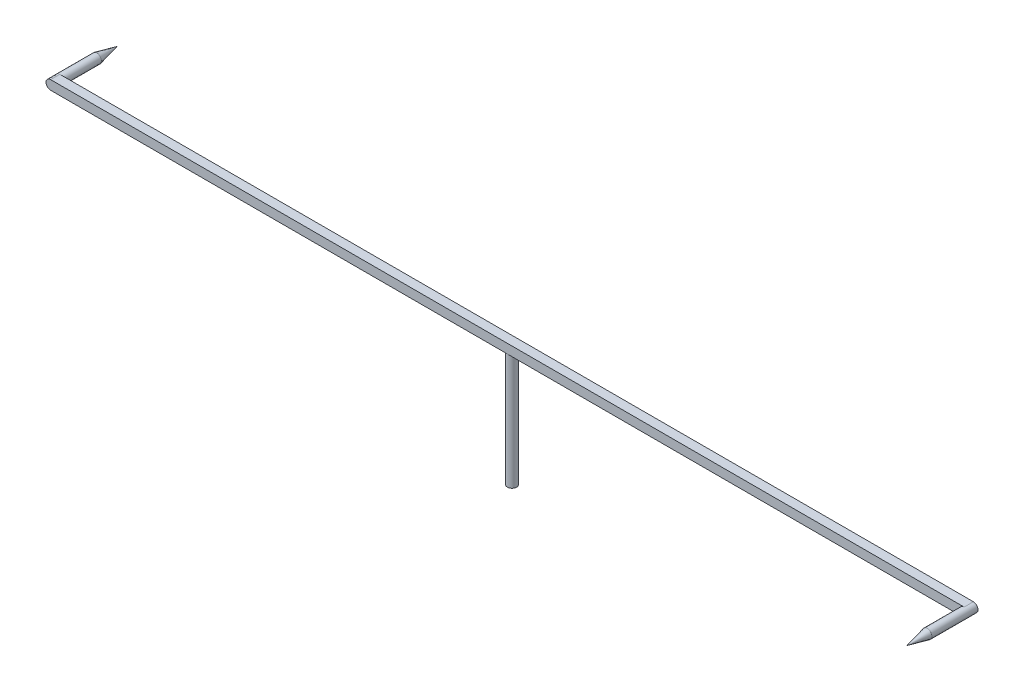
ISO-10303-21;
HEADER;
FILE_DESCRIPTION(('STEP AP214'),'2;1');
FILE_NAME('part.step','',(''),(''),'','','');
FILE_SCHEMA(('AUTOMOTIVE_DESIGN { 1 0 10303 214 1 1 1 1 }'));
ENDSEC;
DATA;
#1=APPLICATION_CONTEXT('core data for automotive mechanical design processes');
#2=APPLICATION_PROTOCOL_DEFINITION('international standard','automotive_design',2000,#1);
#3=PRODUCT_CONTEXT('',#1,'mechanical');
#4=PRODUCT('Part','Part','',(#3));
#5=PRODUCT_RELATED_PRODUCT_CATEGORY('part','',(#4));
#6=PRODUCT_DEFINITION_FORMATION('','',#4);
#7=PRODUCT_DEFINITION_CONTEXT('part definition',#1,'design');
#8=PRODUCT_DEFINITION('design','',#6,#7);
#9=PRODUCT_DEFINITION_SHAPE('','',#8);
#10=(LENGTH_UNIT() NAMED_UNIT(*) SI_UNIT(.MILLI.,.METRE.));
#11=(NAMED_UNIT(*) PLANE_ANGLE_UNIT() SI_UNIT($,.RADIAN.));
#12=(NAMED_UNIT(*) SI_UNIT($,.STERADIAN.) SOLID_ANGLE_UNIT());
#13=UNCERTAINTY_MEASURE_WITH_UNIT(LENGTH_MEASURE(1.E-05),#10,'distance_accuracy_value','');
#14=(GEOMETRIC_REPRESENTATION_CONTEXT(3) GLOBAL_UNCERTAINTY_ASSIGNED_CONTEXT((#13)) GLOBAL_UNIT_ASSIGNED_CONTEXT((#10,
#11,#12)) REPRESENTATION_CONTEXT('',''));
#15=CARTESIAN_POINT('',(0.,0.,0.));
#16=DIRECTION('',(0.,0.,1.));
#17=DIRECTION('',(1.,0.,0.));
#18=AXIS2_PLACEMENT_3D('',#15,#16,#17);
#19=CARTESIAN_POINT('',(0.,10.,0.));
#20=DIRECTION('',(0.,-1.,0.));
#21=DIRECTION('',(0.,0.,-1.));
#22=AXIS2_PLACEMENT_3D('',#19,#20,#21);
#23=CYLINDRICAL_SURFACE('',#22,0.4);
#24=CARTESIAN_POINT('',(0.,10.,0.));
#25=DIRECTION('',(0.,1.,0.));
#26=DIRECTION('',(0.,0.,1.));
#27=AXIS2_PLACEMENT_3D('',#24,#25,#26);
#28=CIRCLE('',#27,0.4);
#29=CARTESIAN_POINT('',(0.,10.,0.4));
#30=VERTEX_POINT('',#29);
#31=CARTESIAN_POINT('',(0.,10.,-0.4));
#32=VERTEX_POINT('',#31);
#33=EDGE_CURVE('E162',#30,#32,#28,.T.);
#34=ORIENTED_EDGE('',*,*,#33,.F.);
#35=EDGE_CURVE('E166',#32,#30,#28,.T.);
#36=ORIENTED_EDGE('',*,*,#35,.F.);
#37=EDGE_LOOP('',(#34,#36));
#38=FACE_BOUND('',#37,.T.);
#39=CARTESIAN_POINT('',(0.,0.,0.));
#40=DIRECTION('',(0.,1.,0.));
#41=DIRECTION('',(0.,0.,1.));
#42=AXIS2_PLACEMENT_3D('',#39,#40,#41);
#43=CIRCLE('',#42,0.4);
#44=CARTESIAN_POINT('',(0.,0.,0.4));
#45=VERTEX_POINT('',#44);
#46=EDGE_CURVE('E156',#45,#45,#43,.T.);
#47=ORIENTED_EDGE('',*,*,#46,.T.);
#48=EDGE_LOOP('',(#47));
#49=FACE_BOUND('',#48,.T.);
#50=ADVANCED_FACE('F35',(#38,#49),#23,.T.);
#51=CARTESIAN_POINT('',(0.,0.,0.));
#52=DIRECTION('',(0.,1.,0.));
#53=DIRECTION('',(0.,0.,1.));
#54=AXIS2_PLACEMENT_3D('',#51,#52,#53);
#55=PLANE('',#54);
#56=ORIENTED_EDGE('',*,*,#46,.F.);
#57=EDGE_LOOP('',(#56));
#58=FACE_BOUND('',#57,.T.);
#59=ADVANCED_FACE('F112',(#58),#55,.F.);
#60=CARTESIAN_POINT('',(0.,10.,0.));
#61=DIRECTION('',(0.,1.,0.));
#62=DIRECTION('',(0.,0.,1.));
#63=AXIS2_PLACEMENT_3D('',#60,#61,#62);
#64=PLANE('',#63);
#65=DIRECTION('',(-1.,0.,0.));
#66=VECTOR('',#65,1.);
#67=CARTESIAN_POINT('',(-40.,10.,-0.4));
#68=LINE('',#67,#66);
#69=CARTESIAN_POINT('',(39.6,10.,-0.4));
#70=VERTEX_POINT('',#69);
#71=EDGE_CURVE('E154',#70,#32,#68,.T.);
#72=ORIENTED_EDGE('',*,*,#71,.F.);
#73=DIRECTION('',(0.,0.,-1.));
#74=VECTOR('',#73,1.);
#75=CARTESIAN_POINT('',(39.6,10.,0.));
#76=LINE('',#75,#74);
#77=CARTESIAN_POINT('',(39.6,10.,0.4));
#78=VERTEX_POINT('',#77);
#79=EDGE_CURVE('E11',#70,#78,#76,.F.);
#80=ORIENTED_EDGE('',*,*,#79,.T.);
#81=DIRECTION('',(1.,0.,0.));
#82=VECTOR('',#81,1.);
#83=CARTESIAN_POINT('',(-40.,10.,0.4));
#84=LINE('',#83,#82);
#85=EDGE_CURVE('E160',#30,#78,#84,.T.);
#86=ORIENTED_EDGE('',*,*,#85,.F.);
#87=ORIENTED_EDGE('',*,*,#33,.T.);
#88=EDGE_LOOP('',(#72,#80,#86,#87));
#89=FACE_BOUND('',#88,.T.);
#90=ADVANCED_FACE('F118',(#89),#64,.F.);
#91=CARTESIAN_POINT('',(-39.6,10.,0.4));
#92=VERTEX_POINT('',#91);
#93=EDGE_CURVE('E157',#92,#30,#84,.T.);
#94=ORIENTED_EDGE('',*,*,#93,.F.);
#95=DIRECTION('',(0.,0.,1.));
#96=VECTOR('',#95,1.);
#97=CARTESIAN_POINT('',(-39.6,10.,0.));
#98=LINE('',#97,#96);
#99=CARTESIAN_POINT('',(-39.6,10.,-0.4));
#100=VERTEX_POINT('',#99);
#101=EDGE_CURVE('E172',#92,#100,#98,.F.);
#102=ORIENTED_EDGE('',*,*,#101,.T.);
#103=EDGE_CURVE('E159',#32,#100,#68,.T.);
#104=ORIENTED_EDGE('',*,*,#103,.F.);
#105=ORIENTED_EDGE('',*,*,#35,.T.);
#106=EDGE_LOOP('',(#94,#102,#104,#105));
#107=FACE_BOUND('',#106,.T.);
#108=ADVANCED_FACE('F195',(#107),#64,.F.);
#109=CARTESIAN_POINT('',(-40.,10.8,0.4));
#110=DIRECTION('',(0.,0.,-1.));
#111=DIRECTION('',(-1.,0.,0.));
#112=AXIS2_PLACEMENT_3D('',#109,#110,#111);
#113=PLANE('',#112);
#114=CARTESIAN_POINT('',(39.6,10.4,0.4));
#115=DIRECTION('',(0.,0.,1.));
#116=DIRECTION('',(1.,0.,0.));
#117=AXIS2_PLACEMENT_3D('',#114,#115,#116);
#118=CIRCLE('',#117,0.399999999999998);
#119=CARTESIAN_POINT('',(39.6,10.8,0.4));
#120=VERTEX_POINT('',#119);
#121=EDGE_CURVE('E141',#120,#78,#118,.T.);
#122=ORIENTED_EDGE('',*,*,#121,.F.);
#123=DIRECTION('',(1.,0.,0.));
#124=VECTOR('',#123,1.);
#125=CARTESIAN_POINT('',(-40.,10.8,0.4));
#126=LINE('',#125,#124);
#127=CARTESIAN_POINT('',(-39.6,10.8,0.4));
#128=VERTEX_POINT('',#127);
#129=EDGE_CURVE('E150',#128,#120,#126,.T.);
#130=ORIENTED_EDGE('',*,*,#129,.F.);
#131=CARTESIAN_POINT('',(-39.6,10.4,0.4));
#132=DIRECTION('',(0.,0.,-1.));
#133=DIRECTION('',(-1.,0.,0.));
#134=AXIS2_PLACEMENT_3D('',#131,#132,#133);
#135=CIRCLE('',#134,0.4);
#136=CARTESIAN_POINT('',(-40.,10.4,0.4));
#137=VERTEX_POINT('',#136);
#138=EDGE_CURVE('E165',#128,#137,#135,.F.);
#139=ORIENTED_EDGE('',*,*,#138,.T.);
#140=CARTESIAN_POINT('',(-39.6,10.4,0.4));
#141=DIRECTION('',(0.,0.,-1.));
#142=DIRECTION('',(-1.,0.,0.));
#143=AXIS2_PLACEMENT_3D('',#140,#141,#142);
#144=CIRCLE('',#143,0.4);
#145=EDGE_CURVE('E170',#137,#92,#144,.F.);
#146=ORIENTED_EDGE('',*,*,#145,.T.);
#147=ORIENTED_EDGE('',*,*,#93,.T.);
#148=ORIENTED_EDGE('',*,*,#85,.T.);
#149=EDGE_LOOP('',(#122,#130,#139,#146,#147,#148));
#150=FACE_BOUND('',#149,.T.);
#151=ADVANCED_FACE('F198',(#150),#113,.F.);
#152=CARTESIAN_POINT('',(-40.,10.8,-0.4));
#153=DIRECTION('',(0.,0.,1.));
#154=DIRECTION('',(1.,0.,0.));
#155=AXIS2_PLACEMENT_3D('',#152,#153,#154);
#156=PLANE('',#155);
#157=CARTESIAN_POINT('',(-39.6,10.4,-0.4));
#158=DIRECTION('',(0.,0.,-1.));
#159=DIRECTION('',(-1.,0.,0.));
#160=AXIS2_PLACEMENT_3D('',#157,#158,#159);
#161=CIRCLE('',#160,0.399999999999998);
#162=CARTESIAN_POINT('',(-39.6,10.8,-0.4));
#163=VERTEX_POINT('',#162);
#164=EDGE_CURVE('E58',#163,#100,#161,.T.);
#165=ORIENTED_EDGE('',*,*,#164,.F.);
#166=DIRECTION('',(-1.,0.,0.));
#167=VECTOR('',#166,1.);
#168=CARTESIAN_POINT('',(-40.,10.8,-0.4));
#169=LINE('',#168,#167);
#170=CARTESIAN_POINT('',(39.6,10.8,-0.4));
#171=VERTEX_POINT('',#170);
#172=EDGE_CURVE('E153',#171,#163,#169,.T.);
#173=ORIENTED_EDGE('',*,*,#172,.F.);
#174=CARTESIAN_POINT('',(39.6,10.4,-0.4));
#175=DIRECTION('',(0.,0.,1.));
#176=DIRECTION('',(1.,0.,0.));
#177=AXIS2_PLACEMENT_3D('',#174,#175,#176);
#178=CIRCLE('',#177,0.4);
#179=CARTESIAN_POINT('',(40.,10.4,-0.4));
#180=VERTEX_POINT('',#179);
#181=EDGE_CURVE('E52',#171,#180,#178,.F.);
#182=ORIENTED_EDGE('',*,*,#181,.T.);
#183=CARTESIAN_POINT('',(39.6,10.4,-0.4));
#184=DIRECTION('',(0.,0.,1.));
#185=DIRECTION('',(1.,0.,0.));
#186=AXIS2_PLACEMENT_3D('',#183,#184,#185);
#187=CIRCLE('',#186,0.4);
#188=EDGE_CURVE('E175',#180,#70,#187,.F.);
#189=ORIENTED_EDGE('',*,*,#188,.T.);
#190=ORIENTED_EDGE('',*,*,#71,.T.);
#191=ORIENTED_EDGE('',*,*,#103,.T.);
#192=EDGE_LOOP('',(#165,#173,#182,#189,#190,#191));
#193=FACE_BOUND('',#192,.T.);
#194=ADVANCED_FACE('F133',(#193),#156,.F.);
#195=CARTESIAN_POINT('',(0.,10.8,0.));
#196=DIRECTION('',(0.,1.,0.));
#197=DIRECTION('',(0.,0.,1.));
#198=AXIS2_PLACEMENT_3D('',#195,#196,#197);
#199=PLANE('',#198);
#200=ORIENTED_EDGE('',*,*,#172,.T.);
#201=DIRECTION('',(0.,0.,1.));
#202=VECTOR('',#201,1.);
#203=CARTESIAN_POINT('',(-39.6,10.8,0.4));
#204=LINE('',#203,#202);
#205=EDGE_CURVE('E44',#163,#128,#204,.T.);
#206=ORIENTED_EDGE('',*,*,#205,.T.);
#207=ORIENTED_EDGE('',*,*,#129,.T.);
#208=DIRECTION('',(0.,0.,-1.));
#209=VECTOR('',#208,1.);
#210=CARTESIAN_POINT('',(39.6,10.8,-0.4));
#211=LINE('',#210,#209);
#212=EDGE_CURVE('E177',#120,#171,#211,.T.);
#213=ORIENTED_EDGE('',*,*,#212,.T.);
#214=EDGE_LOOP('',(#200,#206,#207,#213));
#215=FACE_BOUND('',#214,.T.);
#216=ADVANCED_FACE('F126',(#215),#199,.T.);
#217=CARTESIAN_POINT('',(-39.6,10.4,0.));
#218=DIRECTION('',(0.,0.,-1.));
#219=DIRECTION('',(-1.,0.,0.));
#220=AXIS2_PLACEMENT_3D('',#217,#218,#219);
#221=CYLINDRICAL_SURFACE('',#220,0.4);
#222=ORIENTED_EDGE('',*,*,#205,.F.);
#223=ORIENTED_EDGE('',*,*,#164,.T.);
#224=ORIENTED_EDGE('',*,*,#101,.F.);
#225=ORIENTED_EDGE('',*,*,#145,.F.);
#226=DIRECTION('',(0.,0.,1.));
#227=VECTOR('',#226,1.);
#228=CARTESIAN_POINT('',(-40.,10.4,-0.4));
#229=LINE('',#228,#227);
#230=CARTESIAN_POINT('',(-40.,10.4,-0.4));
#231=VERTEX_POINT('',#230);
#232=EDGE_CURVE('E179',#137,#231,#229,.F.);
#233=ORIENTED_EDGE('',*,*,#232,.T.);
#234=ORIENTED_EDGE('',*,*,#232,.F.);
#235=ORIENTED_EDGE('',*,*,#138,.F.);
#236=EDGE_LOOP('',(#222,#223,#224,#225,#233,#234,#235));
#237=FACE_BOUND('',#236,.T.);
#238=CARTESIAN_POINT('',(-39.6,10.4,-3.6));
#239=DIRECTION('',(0.,0.,-1.));
#240=DIRECTION('',(-1.,0.,0.));
#241=AXIS2_PLACEMENT_3D('',#238,#239,#240);
#242=CIRCLE('',#241,0.399999999999998);
#243=CARTESIAN_POINT('',(-40.,10.4,-3.6));
#244=VERTEX_POINT('',#243);
#245=EDGE_CURVE('E140',#244,#244,#242,.T.);
#246=ORIENTED_EDGE('',*,*,#245,.F.);
#247=EDGE_LOOP('',(#246));
#248=FACE_BOUND('',#247,.T.);
#249=ADVANCED_FACE('F124',(#237,#248),#221,.T.);
#250=CARTESIAN_POINT('',(39.6,10.4,0.));
#251=DIRECTION('',(0.,0.,1.));
#252=DIRECTION('',(1.,0.,0.));
#253=AXIS2_PLACEMENT_3D('',#250,#251,#252);
#254=CYLINDRICAL_SURFACE('',#253,0.4);
#255=ORIENTED_EDGE('',*,*,#212,.F.);
#256=ORIENTED_EDGE('',*,*,#121,.T.);
#257=ORIENTED_EDGE('',*,*,#79,.F.);
#258=ORIENTED_EDGE('',*,*,#188,.F.);
#259=DIRECTION('',(0.,0.,-1.));
#260=VECTOR('',#259,1.);
#261=CARTESIAN_POINT('',(40.,10.4,0.4));
#262=LINE('',#261,#260);
#263=CARTESIAN_POINT('',(40.,10.4,0.4));
#264=VERTEX_POINT('',#263);
#265=EDGE_CURVE('E39',#180,#264,#262,.F.);
#266=ORIENTED_EDGE('',*,*,#265,.T.);
#267=ORIENTED_EDGE('',*,*,#265,.F.);
#268=ORIENTED_EDGE('',*,*,#181,.F.);
#269=EDGE_LOOP('',(#255,#256,#257,#258,#266,#267,#268));
#270=FACE_BOUND('',#269,.T.);
#271=CARTESIAN_POINT('',(39.6,10.4,3.6));
#272=DIRECTION('',(0.,0.,1.));
#273=DIRECTION('',(1.,0.,0.));
#274=AXIS2_PLACEMENT_3D('',#271,#272,#273);
#275=CIRCLE('',#274,0.399999999999998);
#276=CARTESIAN_POINT('',(40.,10.4,3.6));
#277=VERTEX_POINT('',#276);
#278=EDGE_CURVE('E144',#277,#277,#275,.T.);
#279=ORIENTED_EDGE('',*,*,#278,.F.);
#280=EDGE_LOOP('',(#279));
#281=FACE_BOUND('',#280,.T.);
#282=ADVANCED_FACE('F37',(#270,#281),#254,.T.);
#283=CARTESIAN_POINT('',(39.6,10.4,5.4));
#284=DIRECTION('',(0.,0.,-1.));
#285=DIRECTION('',(-1.,0.,0.));
#286=AXIS2_PLACEMENT_3D('',#283,#284,#285);
#287=CONICAL_SURFACE('',#286,0.,0.218668945873941);
#288=ORIENTED_EDGE('',*,*,#278,.T.);
#289=EDGE_LOOP('',(#288));
#290=FACE_BOUND('',#289,.T.);
#291=CARTESIAN_POINT('',(39.6,10.4,5.4));
#292=VERTEX_POINT('',#291);
#293=VERTEX_LOOP('',#292);
#294=FACE_BOUND('',#293,.T.);
#295=ADVANCED_FACE('F102',(#290,#294),#287,.T.);
#296=CARTESIAN_POINT('',(-39.6,10.4,-5.4));
#297=DIRECTION('',(0.,0.,1.));
#298=DIRECTION('',(1.,0.,0.));
#299=AXIS2_PLACEMENT_3D('',#296,#297,#298);
#300=CONICAL_SURFACE('',#299,0.,0.218668945873941);
#301=ORIENTED_EDGE('',*,*,#245,.T.);
#302=EDGE_LOOP('',(#301));
#303=FACE_BOUND('',#302,.T.);
#304=CARTESIAN_POINT('',(-39.6,10.4,-5.4));
#305=VERTEX_POINT('',#304);
#306=VERTEX_LOOP('',#305);
#307=FACE_BOUND('',#306,.T.);
#308=ADVANCED_FACE('F100',(#303,#307),#300,.T.);
#309=CLOSED_SHELL('',(#50,#59,#90,#108,#151,#194,#216,#249,#282,#295,#308));
#310=MANIFOLD_SOLID_BREP('B2',#309);
#311=ADVANCED_BREP_SHAPE_REPRESENTATION('',(#18,#310),#14);
#312=SHAPE_DEFINITION_REPRESENTATION(#9,#311);
ENDSEC;
END-ISO-10303-21;
